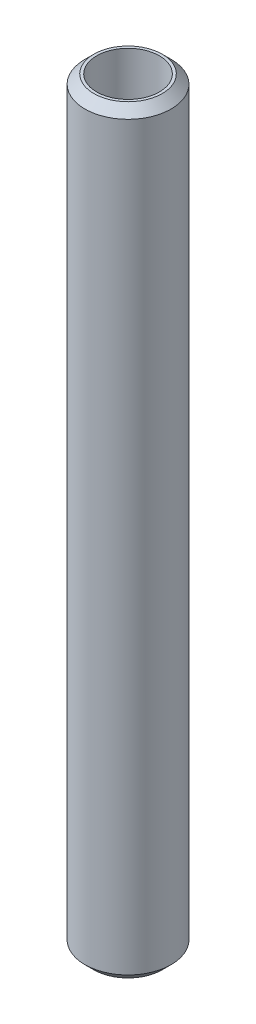
ISO-10303-21;
HEADER;
FILE_DESCRIPTION(('STEP AP214'),'2;1');
FILE_NAME('part.step','',(''),(''),'','','');
FILE_SCHEMA(('AUTOMOTIVE_DESIGN { 1 0 10303 214 1 1 1 1 }'));
ENDSEC;
DATA;
#1=APPLICATION_CONTEXT('core data for automotive mechanical design processes');
#2=APPLICATION_PROTOCOL_DEFINITION('international standard','automotive_design',2000,#1);
#3=PRODUCT_CONTEXT('',#1,'mechanical');
#4=PRODUCT('Part','Part','',(#3));
#5=PRODUCT_RELATED_PRODUCT_CATEGORY('part','',(#4));
#6=PRODUCT_DEFINITION_FORMATION('','',#4);
#7=PRODUCT_DEFINITION_CONTEXT('part definition',#1,'design');
#8=PRODUCT_DEFINITION('design','',#6,#7);
#9=PRODUCT_DEFINITION_SHAPE('','',#8);
#10=(LENGTH_UNIT() NAMED_UNIT(*) SI_UNIT(.MILLI.,.METRE.));
#11=(NAMED_UNIT(*) PLANE_ANGLE_UNIT() SI_UNIT($,.RADIAN.));
#12=(NAMED_UNIT(*) SI_UNIT($,.STERADIAN.) SOLID_ANGLE_UNIT());
#13=UNCERTAINTY_MEASURE_WITH_UNIT(LENGTH_MEASURE(1.E-05),#10,'distance_accuracy_value','');
#14=(GEOMETRIC_REPRESENTATION_CONTEXT(3) GLOBAL_UNCERTAINTY_ASSIGNED_CONTEXT((#13)) GLOBAL_UNIT_ASSIGNED_CONTEXT((#10,
#11,#12)) REPRESENTATION_CONTEXT('',''));
#15=CARTESIAN_POINT('',(0.,0.,0.));
#16=DIRECTION('',(0.,0.,1.));
#17=DIRECTION('',(1.,0.,0.));
#18=AXIS2_PLACEMENT_3D('',#15,#16,#17);
#19=CARTESIAN_POINT('',(0.,396.279738216914,0.));
#20=DIRECTION('',(0.,-1.,0.));
#21=DIRECTION('',(0.,0.,-1.));
#22=AXIS2_PLACEMENT_3D('',#19,#20,#21);
#23=CYLINDRICAL_SURFACE('',#22,22.5);
#24=CARTESIAN_POINT('',(0.,391.619146174908,0.));
#25=DIRECTION('',(0.,1.,0.));
#26=DIRECTION('',(0.,0.,1.));
#27=AXIS2_PLACEMENT_3D('',#24,#25,#26);
#28=CIRCLE('',#27,22.5);
#29=CARTESIAN_POINT('',(0.,391.619146174908,-22.5));
#30=VERTEX_POINT('',#29);
#31=EDGE_CURVE('E50',#30,#30,#28,.F.);
#32=ORIENTED_EDGE('',*,*,#31,.T.);
#33=EDGE_LOOP('',(#32));
#34=FACE_BOUND('',#33,.T.);
#35=CARTESIAN_POINT('',(0.,4.66059204200575,0.));
#36=DIRECTION('',(0.,1.,0.));
#37=DIRECTION('',(0.,0.,1.));
#38=AXIS2_PLACEMENT_3D('',#35,#36,#37);
#39=CIRCLE('',#38,22.5);
#40=CARTESIAN_POINT('',(0.,4.66059204200575,22.5));
#41=VERTEX_POINT('',#40);
#42=EDGE_CURVE('E51',#41,#41,#39,.T.);
#43=ORIENTED_EDGE('',*,*,#42,.T.);
#44=EDGE_LOOP('',(#43));
#45=FACE_BOUND('',#44,.T.);
#46=ADVANCED_FACE('F39',(#34,#45),#23,.T.);
#47=CARTESIAN_POINT('',(0.,396.279738216914,0.));
#48=DIRECTION('',(0.,1.,0.));
#49=DIRECTION('',(0.,0.,1.));
#50=AXIS2_PLACEMENT_3D('',#47,#48,#49);
#51=PLANE('',#50);
#52=CARTESIAN_POINT('',(0.,396.279738216914,0.));
#53=DIRECTION('',(0.,1.,0.));
#54=DIRECTION('',(0.,0.,1.));
#55=AXIS2_PLACEMENT_3D('',#52,#53,#54);
#56=CIRCLE('',#55,17.8394079579942);
#57=CARTESIAN_POINT('',(0.,396.279738216914,-17.8394079579942));
#58=VERTEX_POINT('',#57);
#59=EDGE_CURVE('E54',#58,#58,#56,.T.);
#60=ORIENTED_EDGE('',*,*,#59,.T.);
#61=EDGE_LOOP('',(#60));
#62=FACE_BOUND('',#61,.T.);
#63=CARTESIAN_POINT('',(0.,396.279738216914,0.));
#64=DIRECTION('',(0.,1.,0.));
#65=DIRECTION('',(0.,0.,1.));
#66=AXIS2_PLACEMENT_3D('',#63,#64,#65);
#67=CIRCLE('',#66,16.3802347945509);
#68=CARTESIAN_POINT('',(0.,396.279738216914,16.3802347945509));
#69=VERTEX_POINT('',#68);
#70=EDGE_CURVE('E58',#69,#69,#67,.T.);
#71=ORIENTED_EDGE('',*,*,#70,.F.);
#72=EDGE_LOOP('',(#71));
#73=FACE_BOUND('',#72,.T.);
#74=ADVANCED_FACE('F69',(#62,#73),#51,.T.);
#75=CARTESIAN_POINT('',(0.,0.,0.));
#76=DIRECTION('',(0.,1.,0.));
#77=DIRECTION('',(0.,0.,1.));
#78=AXIS2_PLACEMENT_3D('',#75,#76,#77);
#79=PLANE('',#78);
#80=CARTESIAN_POINT('',(0.,0.,0.));
#81=DIRECTION('',(0.,1.,0.));
#82=DIRECTION('',(0.,0.,1.));
#83=AXIS2_PLACEMENT_3D('',#80,#81,#82);
#84=CIRCLE('',#83,17.8394079579942);
#85=CARTESIAN_POINT('',(0.,0.,17.8394079579942));
#86=VERTEX_POINT('',#85);
#87=EDGE_CURVE('E10',#86,#86,#84,.F.);
#88=ORIENTED_EDGE('',*,*,#87,.T.);
#89=EDGE_LOOP('',(#88));
#90=FACE_BOUND('',#89,.T.);
#91=CARTESIAN_POINT('',(0.,0.,0.));
#92=DIRECTION('',(0.,1.,0.));
#93=DIRECTION('',(0.,0.,1.));
#94=AXIS2_PLACEMENT_3D('',#91,#92,#93);
#95=CIRCLE('',#94,16.3802347945509);
#96=CARTESIAN_POINT('',(0.,0.,16.3802347945509));
#97=VERTEX_POINT('',#96);
#98=EDGE_CURVE('E63',#97,#97,#95,.T.);
#99=ORIENTED_EDGE('',*,*,#98,.T.);
#100=EDGE_LOOP('',(#99));
#101=FACE_BOUND('',#100,.T.);
#102=ADVANCED_FACE('F75',(#90,#101),#79,.F.);
#103=CARTESIAN_POINT('',(0.,396.279738216914,0.));
#104=DIRECTION('',(0.,-1.,0.));
#105=DIRECTION('',(0.,0.,-1.));
#106=AXIS2_PLACEMENT_3D('',#103,#104,#105);
#107=CYLINDRICAL_SURFACE('',#106,16.3802347945509);
#108=ORIENTED_EDGE('',*,*,#70,.T.);
#109=EDGE_LOOP('',(#108));
#110=FACE_BOUND('',#109,.T.);
#111=ORIENTED_EDGE('',*,*,#98,.F.);
#112=EDGE_LOOP('',(#111));
#113=FACE_BOUND('',#112,.T.);
#114=ADVANCED_FACE('F70',(#110,#113),#107,.F.);
#115=CARTESIAN_POINT('',(0.,396.279738216914,0.));
#116=DIRECTION('',(0.,-1.,0.));
#117=DIRECTION('',(0.,0.,-1.));
#118=AXIS2_PLACEMENT_3D('',#115,#116,#117);
#119=CONICAL_SURFACE('',#118,17.8394079579942,0.78539816339744);
#120=CARTESIAN_POINT('',(0.,391.619146174908,-22.5));
#121=CARTESIAN_POINT('',(0.,391.667694008679,-22.4514521662291));
#122=CARTESIAN_POINT('',(0.,391.71624184245,-22.4029043324582));
#123=CARTESIAN_POINT('',(0.,391.813337509992,-22.3058086649165));
#124=CARTESIAN_POINT('',(0.,391.861885343763,-22.2572608311456));
#125=CARTESIAN_POINT('',(0.,391.958981011305,-22.1601651636038));
#126=CARTESIAN_POINT('',(0.,392.007528845075,-22.1116173298329));
#127=CARTESIAN_POINT('',(0.,392.104624512617,-22.0145216622911));
#128=CARTESIAN_POINT('',(0.,392.153172346388,-21.9659738285202));
#129=CARTESIAN_POINT('',(0.,392.25026801393,-21.8688781609784));
#130=CARTESIAN_POINT('',(0.,392.298815847701,-21.8203303272075));
#131=CARTESIAN_POINT('',(0.,392.395911515243,-21.7232346596657));
#132=CARTESIAN_POINT('',(0.,392.444459349014,-21.6746868258948));
#133=CARTESIAN_POINT('',(0.,392.541555016555,-21.577591158353));
#134=CARTESIAN_POINT('',(0.,392.590102850326,-21.5290433245821));
#135=CARTESIAN_POINT('',(0.,392.687198517868,-21.4319476570404));
#136=CARTESIAN_POINT('',(0.,392.735746351639,-21.3833998232695));
#137=CARTESIAN_POINT('',(0.,392.832842019181,-21.2863041557277));
#138=CARTESIAN_POINT('',(0.,392.881389852952,-21.2377563219568));
#139=CARTESIAN_POINT('',(0.,392.978485520493,-21.140660654415));
#140=CARTESIAN_POINT('',(0.,393.027033354264,-21.0921128206441));
#141=CARTESIAN_POINT('',(0.,393.124129021806,-20.9950171531023));
#142=CARTESIAN_POINT('',(0.,393.172676855577,-20.9464693193314));
#143=CARTESIAN_POINT('',(0.,393.269772523119,-20.8493736517896));
#144=CARTESIAN_POINT('',(0.,393.31832035689,-20.8008258180187));
#145=CARTESIAN_POINT('',(0.,393.415416024431,-20.7037301504769));
#146=CARTESIAN_POINT('',(0.,393.463963858202,-20.6551823167061));
#147=CARTESIAN_POINT('',(0.,393.561059525744,-20.5580866491643));
#148=CARTESIAN_POINT('',(0.,393.609607359515,-20.5095388153934));
#149=CARTESIAN_POINT('',(0.,393.706703027057,-20.4124431478516));
#150=CARTESIAN_POINT('',(0.,393.755250860828,-20.3638953140807));
#151=CARTESIAN_POINT('',(0.,393.852346528369,-20.2667996465389));
#152=CARTESIAN_POINT('',(0.,393.90089436214,-20.218251812768));
#153=CARTESIAN_POINT('',(0.,393.997990029682,-20.1211561452262));
#154=CARTESIAN_POINT('',(0.,394.046537863453,-20.0726083114553));
#155=CARTESIAN_POINT('',(0.,394.143633530995,-19.9755126439135));
#156=CARTESIAN_POINT('',(0.,394.192181364766,-19.9269648101426));
#157=CARTESIAN_POINT('',(0.,394.289277032308,-19.8298691426009));
#158=CARTESIAN_POINT('',(0.,394.337824866078,-19.78132130883));
#159=CARTESIAN_POINT('',(0.,394.43492053362,-19.6842256412882));
#160=CARTESIAN_POINT('',(0.,394.483468367391,-19.6356778075173));
#161=CARTESIAN_POINT('',(0.,394.580564034933,-19.5385821399755));
#162=CARTESIAN_POINT('',(0.,394.629111868704,-19.4900343062046));
#163=CARTESIAN_POINT('',(0.,394.726207536246,-19.3929386386628));
#164=CARTESIAN_POINT('',(0.,394.774755370017,-19.3443908048919));
#165=CARTESIAN_POINT('',(0.,394.871851037558,-19.2472951373501));
#166=CARTESIAN_POINT('',(0.,394.920398871329,-19.1987473035792));
#167=CARTESIAN_POINT('',(0.,395.017494538871,-19.1016516360374));
#168=CARTESIAN_POINT('',(0.,395.066042372642,-19.0531038022665));
#169=CARTESIAN_POINT('',(0.,395.163138040184,-18.9560081347248));
#170=CARTESIAN_POINT('',(0.,395.211685873955,-18.9074603009539));
#171=CARTESIAN_POINT('',(0.,395.308781541496,-18.8103646334121));
#172=CARTESIAN_POINT('',(0.,395.357329375267,-18.7618167996412));
#173=CARTESIAN_POINT('',(0.,395.454425042809,-18.6647211320994));
#174=CARTESIAN_POINT('',(0.,395.50297287658,-18.6161732983285));
#175=CARTESIAN_POINT('',(0.,395.600068544122,-18.5190776307867));
#176=CARTESIAN_POINT('',(0.,395.648616377893,-18.4705297970158));
#177=CARTESIAN_POINT('',(0.,395.745712045434,-18.373434129474));
#178=CARTESIAN_POINT('',(0.,395.794259879205,-18.3248862957031));
#179=CARTESIAN_POINT('',(0.,395.891355546747,-18.2277906281613));
#180=CARTESIAN_POINT('',(0.,395.939903380518,-18.1792427943904));
#181=CARTESIAN_POINT('',(0.,396.03699904806,-18.0821471268487));
#182=CARTESIAN_POINT('',(0.,396.085546881831,-18.0335992930778));
#183=CARTESIAN_POINT('',(0.,396.182642549372,-17.936503625536));
#184=CARTESIAN_POINT('',(0.,396.231190383143,-17.8879557917651));
#185=CARTESIAN_POINT('',(0.,396.279738216914,-17.8394079579942));
#186=B_SPLINE_CURVE_WITH_KNOTS('',3,(#120,#121,#122,#123,#124,#125,#126,#127,#128,#129,#130,
#131,#132,#133,#134,#135,#136,#137,#138,#139,#140,#141,#142,#143,#144,#145,#146,#147,#148,#149,
#150,#151,#152,#153,#154,#155,#156,#157,#158,#159,#160,#161,#162,#163,#164,#165,#166,#167,#168,
#169,#170,#171,#172,#173,#174,#175,#176,#177,#178,#179,#180,#181,#182,#183,#184,#185),
.UNSPECIFIED.,.F.,.F.,(4,2,2,2,2,2,2,2,2,2,2,2,2,2,2,2,2,2,2,2,2,2,2,2,2,2,2,2,2,2,2,2,4),(0.,
0.205971014827903,0.411942029655805,0.617913044483708,0.823884059311611,1.02985507413951,
1.23582608896742,1.44179710379532,1.64776811862322,1.85373913345112,2.05971014827902,
2.26568116310693,2.47165217793483,2.67762319276273,2.88359420759063,3.08956522241854,
3.29553623724644,3.50150725207434,3.70747826690224,3.91344928173015,4.11942029655805,
4.32539131138595,4.53136232621385,4.73733334104176,4.94330435586966,5.14927537069756,
5.35524638552546,5.56121740035337,5.76718841518127,5.97315943000917,6.17913044483707,
6.38510145966498,6.59107247449288),.UNSPECIFIED.);
#187=EDGE_CURVE('BSEAM81',#30,#58,#186,.T.);
#188=ORIENTED_EDGE('',*,*,#31,.F.);
#189=ORIENTED_EDGE('',*,*,#59,.F.);
#190=ORIENTED_EDGE('',*,*,#187,.T.);
#191=ORIENTED_EDGE('',*,*,#187,.F.);
#192=EDGE_LOOP('',(#188,#190,#189,#191));
#193=FACE_BOUND('',#192,.T.);
#194=ADVANCED_FACE('F81',(#193),#119,.T.);
#195=CARTESIAN_POINT('',(0.,4.66059204200575,0.));
#196=DIRECTION('',(0.,1.,0.));
#197=DIRECTION('',(0.,0.,1.));
#198=AXIS2_PLACEMENT_3D('',#195,#196,#197);
#199=CONICAL_SURFACE('',#198,22.5,0.785398163397453);
#200=ORIENTED_EDGE('',*,*,#87,.F.);
#201=EDGE_LOOP('',(#200));
#202=FACE_BOUND('',#201,.T.);
#203=ORIENTED_EDGE('',*,*,#42,.F.);
#204=EDGE_LOOP('',(#203));
#205=FACE_BOUND('',#204,.T.);
#206=ADVANCED_FACE('F45',(#202,#205),#199,.T.);
#207=CLOSED_SHELL('',(#46,#74,#102,#114,#194,#206));
#208=MANIFOLD_SOLID_BREP('B2',#207);
#209=ADVANCED_BREP_SHAPE_REPRESENTATION('',(#18,#208),#14);
#210=SHAPE_DEFINITION_REPRESENTATION(#9,#209);
ENDSEC;
END-ISO-10303-21;
